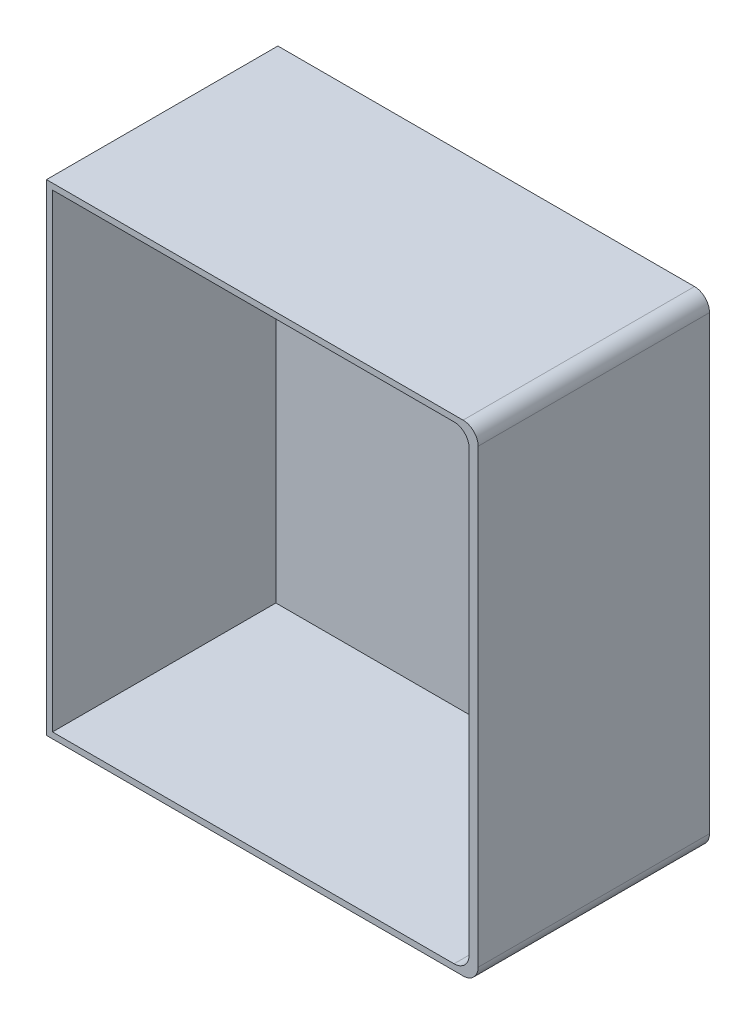
ISO-10303-21;
HEADER;
FILE_DESCRIPTION(('STEP AP214'),'2;1');
FILE_NAME('part.step','',(''),(''),'','','');
FILE_SCHEMA(('AUTOMOTIVE_DESIGN { 1 0 10303 214 1 1 1 1 }'));
ENDSEC;
DATA;
#1=APPLICATION_CONTEXT('core data for automotive mechanical design processes');
#2=APPLICATION_PROTOCOL_DEFINITION('international standard','automotive_design',2000,#1);
#3=PRODUCT_CONTEXT('',#1,'mechanical');
#4=PRODUCT('Part','Part','',(#3));
#5=PRODUCT_RELATED_PRODUCT_CATEGORY('part','',(#4));
#6=PRODUCT_DEFINITION_FORMATION('','',#4);
#7=PRODUCT_DEFINITION_CONTEXT('part definition',#1,'design');
#8=PRODUCT_DEFINITION('design','',#6,#7);
#9=PRODUCT_DEFINITION_SHAPE('','',#8);
#10=(LENGTH_UNIT() NAMED_UNIT(*) SI_UNIT(.MILLI.,.METRE.));
#11=(NAMED_UNIT(*) PLANE_ANGLE_UNIT() SI_UNIT($,.RADIAN.));
#12=(NAMED_UNIT(*) SI_UNIT($,.STERADIAN.) SOLID_ANGLE_UNIT());
#13=UNCERTAINTY_MEASURE_WITH_UNIT(LENGTH_MEASURE(1.E-05),#10,'distance_accuracy_value','');
#14=(GEOMETRIC_REPRESENTATION_CONTEXT(3) GLOBAL_UNCERTAINTY_ASSIGNED_CONTEXT((#13)) GLOBAL_UNIT_ASSIGNED_CONTEXT((#10,
#11,#12)) REPRESENTATION_CONTEXT('',''));
#15=CARTESIAN_POINT('',(0.,0.,0.));
#16=DIRECTION('',(0.,0.,1.));
#17=DIRECTION('',(1.,0.,0.));
#18=AXIS2_PLACEMENT_3D('',#15,#16,#17);
#19=CARTESIAN_POINT('',(-43.,47.95,46.1));
#20=DIRECTION('',(1.,0.,0.));
#21=DIRECTION('',(0.,1.,0.));
#22=AXIS2_PLACEMENT_3D('',#19,#20,#21);
#23=PLANE('',#22);
#24=DIRECTION('',(0.,0.,-1.));
#25=VECTOR('',#24,1.);
#26=CARTESIAN_POINT('',(-43.,-42.95,4.99999999999999));
#27=LINE('',#26,#25);
#28=CARTESIAN_POINT('',(-43.,-42.95,4.99999999999999));
#29=VERTEX_POINT('',#28);
#30=CARTESIAN_POINT('',(-43.,-42.95,0.));
#31=VERTEX_POINT('',#30);
#32=EDGE_CURVE('E218',#29,#31,#27,.T.);
#33=ORIENTED_EDGE('',*,*,#32,.T.);
#34=DIRECTION('',(0.,-1.,0.));
#35=VECTOR('',#34,1.);
#36=CARTESIAN_POINT('',(-43.,47.95,0.));
#37=LINE('',#36,#35);
#38=CARTESIAN_POINT('',(-43.,-47.95,0.));
#39=VERTEX_POINT('',#38);
#40=EDGE_CURVE('E238',#31,#39,#37,.T.);
#41=ORIENTED_EDGE('',*,*,#40,.T.);
#42=DIRECTION('',(0.,0.,-1.));
#43=VECTOR('',#42,1.);
#44=CARTESIAN_POINT('',(-43.,-47.95,46.1));
#45=LINE('',#44,#43);
#46=CARTESIAN_POINT('',(-43.,-47.95,46.1));
#47=VERTEX_POINT('',#46);
#48=EDGE_CURVE('E231',#47,#39,#45,.T.);
#49=ORIENTED_EDGE('',*,*,#48,.F.);
#50=DIRECTION('',(0.,-1.,0.));
#51=VECTOR('',#50,1.);
#52=CARTESIAN_POINT('',(-43.,47.95,46.1));
#53=LINE('',#52,#51);
#54=CARTESIAN_POINT('',(-43.,47.95,46.1));
#55=VERTEX_POINT('',#54);
#56=EDGE_CURVE('E229',#55,#47,#53,.T.);
#57=ORIENTED_EDGE('',*,*,#56,.F.);
#58=DIRECTION('',(0.,0.,-1.));
#59=VECTOR('',#58,1.);
#60=CARTESIAN_POINT('',(-43.,47.95,46.1));
#61=LINE('',#60,#59);
#62=CARTESIAN_POINT('',(-43.,47.95,0.));
#63=VERTEX_POINT('',#62);
#64=EDGE_CURVE('E243',#55,#63,#61,.T.);
#65=ORIENTED_EDGE('',*,*,#64,.T.);
#66=CARTESIAN_POINT('',(-43.,42.95,0.));
#67=VERTEX_POINT('',#66);
#68=EDGE_CURVE('E225',#63,#67,#37,.T.);
#69=ORIENTED_EDGE('',*,*,#68,.T.);
#70=DIRECTION('',(0.,0.,-1.));
#71=VECTOR('',#70,1.);
#72=CARTESIAN_POINT('',(-43.,42.95,4.99999999999999));
#73=LINE('',#72,#71);
#74=CARTESIAN_POINT('',(-43.,42.95,4.99999999999999));
#75=VERTEX_POINT('',#74);
#76=EDGE_CURVE('E205',#75,#67,#73,.T.);
#77=ORIENTED_EDGE('',*,*,#76,.F.);
#78=DIRECTION('',(0.,1.,0.));
#79=VECTOR('',#78,1.);
#80=CARTESIAN_POINT('',(-43.,42.95,4.99999999999999));
#81=LINE('',#80,#79);
#82=CARTESIAN_POINT('',(-43.,35.8706356230274,4.99999999999999));
#83=VERTEX_POINT('',#82);
#84=EDGE_CURVE('E202',#83,#75,#81,.T.);
#85=ORIENTED_EDGE('',*,*,#84,.F.);
#86=DIRECTION('',(0.,0.,-1.));
#87=VECTOR('',#86,1.);
#88=CARTESIAN_POINT('',(-43.,35.8706356230273,4.99999999999999));
#89=LINE('',#88,#87);
#90=CARTESIAN_POINT('',(-43.,35.8706356230273,0.));
#91=VERTEX_POINT('',#90);
#92=EDGE_CURVE('E212',#83,#91,#89,.T.);
#93=ORIENTED_EDGE('',*,*,#92,.T.);
#94=CARTESIAN_POINT('',(-43.,-35.8706356230274,0.));
#95=VERTEX_POINT('',#94);
#96=EDGE_CURVE('E240',#91,#95,#37,.T.);
#97=ORIENTED_EDGE('',*,*,#96,.T.);
#98=DIRECTION('',(0.,0.,-1.));
#99=VECTOR('',#98,1.);
#100=CARTESIAN_POINT('',(-43.,-35.8706356230273,4.99999999999999));
#101=LINE('',#100,#99);
#102=CARTESIAN_POINT('',(-43.,-35.8706356230273,4.99999999999999));
#103=VERTEX_POINT('',#102);
#104=EDGE_CURVE('E215',#103,#95,#101,.T.);
#105=ORIENTED_EDGE('',*,*,#104,.F.);
#106=DIRECTION('',(0.,1.,0.));
#107=VECTOR('',#106,1.);
#108=CARTESIAN_POINT('',(-43.,-42.95,4.99999999999999));
#109=LINE('',#108,#107);
#110=EDGE_CURVE('E195',#29,#103,#109,.T.);
#111=ORIENTED_EDGE('',*,*,#110,.F.);
#112=EDGE_LOOP('',(#33,#41,#49,#57,#65,#69,#77,#85,#93,#97,#105,#111));
#113=FACE_BOUND('',#112,.T.);
#114=ADVANCED_FACE('F41',(#113),#23,.F.);
#115=CARTESIAN_POINT('',(-43.,-47.95,46.1));
#116=DIRECTION('',(0.,1.,0.));
#117=DIRECTION('',(0.,0.,1.));
#118=AXIS2_PLACEMENT_3D('',#115,#116,#117);
#119=PLANE('',#118);
#120=DIRECTION('',(1.,0.,0.));
#121=VECTOR('',#120,1.);
#122=CARTESIAN_POINT('',(-43.,-47.95,0.));
#123=LINE('',#122,#121);
#124=CARTESIAN_POINT('',(40.,-47.95,0.));
#125=VERTEX_POINT('',#124);
#126=EDGE_CURVE('E221',#39,#125,#123,.T.);
#127=ORIENTED_EDGE('',*,*,#126,.T.);
#128=DIRECTION('',(0.,0.,-1.));
#129=VECTOR('',#128,1.);
#130=CARTESIAN_POINT('',(40.,-47.95,46.1));
#131=LINE('',#130,#129);
#132=CARTESIAN_POINT('',(40.,-47.95,46.1));
#133=VERTEX_POINT('',#132);
#134=EDGE_CURVE('E64',#125,#133,#131,.F.);
#135=ORIENTED_EDGE('',*,*,#134,.T.);
#136=DIRECTION('',(1.,0.,0.));
#137=VECTOR('',#136,1.);
#138=CARTESIAN_POINT('',(-43.,-47.95,46.1));
#139=LINE('',#138,#137);
#140=EDGE_CURVE('E222',#47,#133,#139,.T.);
#141=ORIENTED_EDGE('',*,*,#140,.F.);
#142=ORIENTED_EDGE('',*,*,#48,.T.);
#143=EDGE_LOOP('',(#127,#135,#141,#142));
#144=FACE_BOUND('',#143,.T.);
#145=ADVANCED_FACE('F306',(#144),#119,.F.);
#146=CARTESIAN_POINT('',(43.,-47.95,46.1));
#147=DIRECTION('',(-1.,0.,0.));
#148=DIRECTION('',(0.,0.,1.));
#149=AXIS2_PLACEMENT_3D('',#146,#147,#148);
#150=PLANE('',#149);
#151=DIRECTION('',(0.,1.,0.));
#152=VECTOR('',#151,1.);
#153=CARTESIAN_POINT('',(43.,-47.95,46.1));
#154=LINE('',#153,#152);
#155=CARTESIAN_POINT('',(43.,-44.95,46.1));
#156=VERTEX_POINT('',#155);
#157=CARTESIAN_POINT('',(43.,44.95,46.1));
#158=VERTEX_POINT('',#157);
#159=EDGE_CURVE('E224',#156,#158,#154,.T.);
#160=ORIENTED_EDGE('',*,*,#159,.F.);
#161=DIRECTION('',(0.,0.,-1.));
#162=VECTOR('',#161,1.);
#163=CARTESIAN_POINT('',(43.,-44.95,46.1));
#164=LINE('',#163,#162);
#165=CARTESIAN_POINT('',(43.,-44.95,0.));
#166=VERTEX_POINT('',#165);
#167=EDGE_CURVE('E260',#156,#166,#164,.T.);
#168=ORIENTED_EDGE('',*,*,#167,.T.);
#169=DIRECTION('',(0.,1.,0.));
#170=VECTOR('',#169,1.);
#171=CARTESIAN_POINT('',(43.,-47.95,0.));
#172=LINE('',#171,#170);
#173=CARTESIAN_POINT('',(43.,44.95,0.));
#174=VERTEX_POINT('',#173);
#175=EDGE_CURVE('E233',#166,#174,#172,.T.);
#176=ORIENTED_EDGE('',*,*,#175,.T.);
#177=DIRECTION('',(0.,0.,-1.));
#178=VECTOR('',#177,1.);
#179=CARTESIAN_POINT('',(43.,44.95,46.1));
#180=LINE('',#179,#178);
#181=EDGE_CURVE('E258',#174,#158,#180,.F.);
#182=ORIENTED_EDGE('',*,*,#181,.T.);
#183=EDGE_LOOP('',(#160,#168,#176,#182));
#184=FACE_BOUND('',#183,.T.);
#185=ADVANCED_FACE('F312',(#184),#150,.F.);
#186=CARTESIAN_POINT('',(43.,47.95,46.1));
#187=DIRECTION('',(0.,-1.,0.));
#188=DIRECTION('',(1.,0.,0.));
#189=AXIS2_PLACEMENT_3D('',#186,#187,#188);
#190=PLANE('',#189);
#191=DIRECTION('',(-1.,0.,0.));
#192=VECTOR('',#191,1.);
#193=CARTESIAN_POINT('',(43.,47.95,46.1));
#194=LINE('',#193,#192);
#195=CARTESIAN_POINT('',(40.,47.95,46.1));
#196=VERTEX_POINT('',#195);
#197=EDGE_CURVE('E227',#196,#55,#194,.T.);
#198=ORIENTED_EDGE('',*,*,#197,.F.);
#199=DIRECTION('',(0.,0.,-1.));
#200=VECTOR('',#199,1.);
#201=CARTESIAN_POINT('',(40.,47.95,46.1));
#202=LINE('',#201,#200);
#203=CARTESIAN_POINT('',(40.,47.95,0.));
#204=VERTEX_POINT('',#203);
#205=EDGE_CURVE('E271',#196,#204,#202,.T.);
#206=ORIENTED_EDGE('',*,*,#205,.T.);
#207=DIRECTION('',(-1.,0.,0.));
#208=VECTOR('',#207,1.);
#209=CARTESIAN_POINT('',(43.,47.95,0.));
#210=LINE('',#209,#208);
#211=EDGE_CURVE('E236',#204,#63,#210,.T.);
#212=ORIENTED_EDGE('',*,*,#211,.T.);
#213=ORIENTED_EDGE('',*,*,#64,.F.);
#214=EDGE_LOOP('',(#198,#206,#212,#213));
#215=FACE_BOUND('',#214,.T.);
#216=ADVANCED_FACE('F318',(#215),#190,.F.);
#217=CARTESIAN_POINT('',(0.,0.,46.1));
#218=DIRECTION('',(0.,0.,1.));
#219=DIRECTION('',(1.,0.,0.));
#220=AXIS2_PLACEMENT_3D('',#217,#218,#219);
#221=PLANE('',#220);
#222=DIRECTION('',(0.,1.,0.));
#223=VECTOR('',#222,1.);
#224=CARTESIAN_POINT('',(41.2,-46.75,46.1));
#225=LINE('',#224,#223);
#226=CARTESIAN_POINT('',(41.2,-43.75,46.1));
#227=VERTEX_POINT('',#226);
#228=CARTESIAN_POINT('',(41.2,43.75,46.1));
#229=VERTEX_POINT('',#228);
#230=EDGE_CURVE('E168',#227,#229,#225,.T.);
#231=ORIENTED_EDGE('',*,*,#230,.F.);
#232=CARTESIAN_POINT('',(38.2,-43.75,46.1));
#233=DIRECTION('',(0.,0.,1.));
#234=DIRECTION('',(1.,0.,0.));
#235=AXIS2_PLACEMENT_3D('',#232,#233,#234);
#236=CIRCLE('',#235,3.);
#237=CARTESIAN_POINT('',(38.2,-46.75,46.1));
#238=VERTEX_POINT('',#237);
#239=EDGE_CURVE('E49',#227,#238,#236,.F.);
#240=ORIENTED_EDGE('',*,*,#239,.T.);
#241=DIRECTION('',(1.,0.,0.));
#242=VECTOR('',#241,1.);
#243=CARTESIAN_POINT('',(-41.8,-46.75,46.1));
#244=LINE('',#243,#242);
#245=CARTESIAN_POINT('',(-41.8,-46.75,46.1));
#246=VERTEX_POINT('',#245);
#247=EDGE_CURVE('E178',#246,#238,#244,.T.);
#248=ORIENTED_EDGE('',*,*,#247,.F.);
#249=DIRECTION('',(0.,-1.,0.));
#250=VECTOR('',#249,1.);
#251=CARTESIAN_POINT('',(-41.8,46.75,46.1));
#252=LINE('',#251,#250);
#253=CARTESIAN_POINT('',(-41.8,46.75,46.1));
#254=VERTEX_POINT('',#253);
#255=EDGE_CURVE('E167',#254,#246,#252,.T.);
#256=ORIENTED_EDGE('',*,*,#255,.F.);
#257=DIRECTION('',(-1.,0.,0.));
#258=VECTOR('',#257,1.);
#259=CARTESIAN_POINT('',(41.2,46.75,46.1));
#260=LINE('',#259,#258);
#261=CARTESIAN_POINT('',(38.2,46.75,46.1));
#262=VERTEX_POINT('',#261);
#263=EDGE_CURVE('E157',#262,#254,#260,.T.);
#264=ORIENTED_EDGE('',*,*,#263,.F.);
#265=CARTESIAN_POINT('',(38.2,43.75,46.1));
#266=DIRECTION('',(0.,0.,1.));
#267=DIRECTION('',(1.,0.,0.));
#268=AXIS2_PLACEMENT_3D('',#265,#266,#267);
#269=CIRCLE('',#268,3.);
#270=EDGE_CURVE('E12',#262,#229,#269,.F.);
#271=ORIENTED_EDGE('',*,*,#270,.T.);
#272=EDGE_LOOP('',(#231,#240,#248,#256,#264,#271));
#273=FACE_BOUND('',#272,.T.);
#274=ORIENTED_EDGE('',*,*,#140,.T.);
#275=CARTESIAN_POINT('',(40.,-44.95,46.1));
#276=DIRECTION('',(0.,0.,1.));
#277=DIRECTION('',(1.,0.,0.));
#278=AXIS2_PLACEMENT_3D('',#275,#276,#277);
#279=CIRCLE('',#278,3.);
#280=EDGE_CURVE('E269',#133,#156,#279,.T.);
#281=ORIENTED_EDGE('',*,*,#280,.T.);
#282=ORIENTED_EDGE('',*,*,#159,.T.);
#283=CARTESIAN_POINT('',(40.,44.95,46.1));
#284=DIRECTION('',(0.,0.,1.));
#285=DIRECTION('',(1.,0.,0.));
#286=AXIS2_PLACEMENT_3D('',#283,#284,#285);
#287=CIRCLE('',#286,3.);
#288=EDGE_CURVE('E56',#158,#196,#287,.T.);
#289=ORIENTED_EDGE('',*,*,#288,.T.);
#290=ORIENTED_EDGE('',*,*,#197,.T.);
#291=ORIENTED_EDGE('',*,*,#56,.T.);
#292=EDGE_LOOP('',(#274,#281,#282,#289,#290,#291));
#293=FACE_BOUND('',#292,.T.);
#294=ADVANCED_FACE('F181',(#273,#293),#221,.T.);
#295=CARTESIAN_POINT('',(0.,0.,0.));
#296=DIRECTION('',(0.,0.,1.));
#297=DIRECTION('',(1.,0.,0.));
#298=AXIS2_PLACEMENT_3D('',#295,#296,#297);
#299=PLANE('',#298);
#300=CARTESIAN_POINT('',(14.4748640711746,0.,0.));
#301=DIRECTION('',(0.,0.,-1.));
#302=DIRECTION('',(1.,0.,0.));
#303=AXIS2_PLACEMENT_3D('',#300,#301,#302);
#304=CIRCLE('',#303,67.75);
#305=EDGE_CURVE('E196',#95,#91,#304,.T.);
#306=ORIENTED_EDGE('',*,*,#305,.F.);
#307=ORIENTED_EDGE('',*,*,#96,.F.);
#308=EDGE_LOOP('',(#306,#307));
#309=FACE_BOUND('',#308,.T.);
#310=ORIENTED_EDGE('',*,*,#175,.F.);
#311=CARTESIAN_POINT('',(40.,-44.95,0.));
#312=DIRECTION('',(0.,0.,1.));
#313=DIRECTION('',(1.,0.,0.));
#314=AXIS2_PLACEMENT_3D('',#311,#312,#313);
#315=CIRCLE('',#314,3.);
#316=EDGE_CURVE('E265',#166,#125,#315,.F.);
#317=ORIENTED_EDGE('',*,*,#316,.T.);
#318=ORIENTED_EDGE('',*,*,#126,.F.);
#319=ORIENTED_EDGE('',*,*,#40,.F.);
#320=CARTESIAN_POINT('',(14.4748640711746,0.,0.));
#321=DIRECTION('',(0.,0.,1.));
#322=DIRECTION('',(-1.,0.,0.));
#323=AXIS2_PLACEMENT_3D('',#320,#321,#322);
#324=CIRCLE('',#323,71.75);
#325=EDGE_CURVE('E190',#67,#31,#324,.T.);
#326=ORIENTED_EDGE('',*,*,#325,.F.);
#327=ORIENTED_EDGE('',*,*,#68,.F.);
#328=ORIENTED_EDGE('',*,*,#211,.F.);
#329=CARTESIAN_POINT('',(40.,44.95,0.));
#330=DIRECTION('',(0.,0.,1.));
#331=DIRECTION('',(1.,0.,0.));
#332=AXIS2_PLACEMENT_3D('',#329,#330,#331);
#333=CIRCLE('',#332,3.);
#334=EDGE_CURVE('E263',#204,#174,#333,.F.);
#335=ORIENTED_EDGE('',*,*,#334,.T.);
#336=EDGE_LOOP('',(#310,#317,#318,#319,#326,#327,#328,#335));
#337=FACE_BOUND('',#336,.T.);
#338=ADVANCED_FACE('F316',(#309,#337),#299,.F.);
#339=CARTESIAN_POINT('',(14.4748640711746,0.,4.99999999999999));
#340=DIRECTION('',(0.,0.,-1.));
#341=DIRECTION('',(-1.,0.,0.));
#342=AXIS2_PLACEMENT_3D('',#339,#340,#341);
#343=CYLINDRICAL_SURFACE('',#342,71.75);
#344=ORIENTED_EDGE('',*,*,#325,.T.);
#345=ORIENTED_EDGE('',*,*,#32,.F.);
#346=CARTESIAN_POINT('',(14.4748640711746,0.,4.99999999999999));
#347=DIRECTION('',(0.,0.,1.));
#348=DIRECTION('',(-1.,0.,0.));
#349=AXIS2_PLACEMENT_3D('',#346,#347,#348);
#350=CIRCLE('',#349,71.75);
#351=EDGE_CURVE('E192',#75,#29,#350,.T.);
#352=ORIENTED_EDGE('',*,*,#351,.F.);
#353=ORIENTED_EDGE('',*,*,#76,.T.);
#354=EDGE_LOOP('',(#344,#345,#352,#353));
#355=FACE_BOUND('',#354,.T.);
#356=ADVANCED_FACE('F344',(#355),#343,.T.);
#357=CARTESIAN_POINT('',(14.4748640711746,0.,4.99999999999999));
#358=DIRECTION('',(0.,0.,-1.));
#359=DIRECTION('',(-1.,0.,0.));
#360=AXIS2_PLACEMENT_3D('',#357,#358,#359);
#361=CYLINDRICAL_SURFACE('',#360,67.75);
#362=ORIENTED_EDGE('',*,*,#305,.T.);
#363=ORIENTED_EDGE('',*,*,#92,.F.);
#364=CARTESIAN_POINT('',(14.4748640711746,0.,4.99999999999999));
#365=DIRECTION('',(0.,0.,-1.));
#366=DIRECTION('',(1.,0.,0.));
#367=AXIS2_PLACEMENT_3D('',#364,#365,#366);
#368=CIRCLE('',#367,67.75);
#369=EDGE_CURVE('E199',#103,#83,#368,.T.);
#370=ORIENTED_EDGE('',*,*,#369,.F.);
#371=ORIENTED_EDGE('',*,*,#104,.T.);
#372=EDGE_LOOP('',(#362,#363,#370,#371));
#373=FACE_BOUND('',#372,.T.);
#374=ADVANCED_FACE('F342',(#373),#361,.F.);
#375=CARTESIAN_POINT('',(14.4748640711746,0.,4.99999999999999));
#376=DIRECTION('',(0.,0.,-1.));
#377=DIRECTION('',(-1.,0.,0.));
#378=AXIS2_PLACEMENT_3D('',#375,#376,#377);
#379=PLANE('',#378);
#380=ORIENTED_EDGE('',*,*,#351,.T.);
#381=ORIENTED_EDGE('',*,*,#110,.T.);
#382=ORIENTED_EDGE('',*,*,#369,.T.);
#383=ORIENTED_EDGE('',*,*,#84,.T.);
#384=EDGE_LOOP('',(#380,#381,#382,#383));
#385=FACE_BOUND('',#384,.T.);
#386=ADVANCED_FACE('F356',(#385),#379,.F.);
#387=CARTESIAN_POINT('',(41.2,-46.75,-125.0249975005));
#388=DIRECTION('',(1.,0.,0.));
#389=DIRECTION('',(0.,0.,-1.));
#390=AXIS2_PLACEMENT_3D('',#387,#388,#389);
#391=PLANE('',#390);
#392=DIRECTION('',(0.,-1.,0.));
#393=VECTOR('',#392,1.);
#394=CARTESIAN_POINT('',(41.2,-46.75,1.59999999999999));
#395=LINE('',#394,#393);
#396=CARTESIAN_POINT('',(41.2,43.75,1.59999999999999));
#397=VERTEX_POINT('',#396);
#398=CARTESIAN_POINT('',(41.2,-43.75,1.59999999999999));
#399=VERTEX_POINT('',#398);
#400=EDGE_CURVE('E191',#397,#399,#395,.T.);
#401=ORIENTED_EDGE('',*,*,#400,.T.);
#402=DIRECTION('',(0.,0.,1.));
#403=VECTOR('',#402,1.);
#404=CARTESIAN_POINT('',(41.2,-43.75,46.1));
#405=LINE('',#404,#403);
#406=EDGE_CURVE('E248',#399,#227,#405,.T.);
#407=ORIENTED_EDGE('',*,*,#406,.T.);
#408=ORIENTED_EDGE('',*,*,#230,.T.);
#409=DIRECTION('',(0.,0.,1.));
#410=VECTOR('',#409,1.);
#411=CARTESIAN_POINT('',(41.2,43.75,1.59999999999999));
#412=LINE('',#411,#410);
#413=EDGE_CURVE('E246',#229,#397,#412,.F.);
#414=ORIENTED_EDGE('',*,*,#413,.T.);
#415=EDGE_LOOP('',(#401,#407,#408,#414));
#416=FACE_BOUND('',#415,.T.);
#417=ADVANCED_FACE('F289',(#416),#391,.F.);
#418=CARTESIAN_POINT('',(-41.8,-46.75,-125.0249975005));
#419=DIRECTION('',(0.,-1.,0.));
#420=DIRECTION('',(1.,0.,0.));
#421=AXIS2_PLACEMENT_3D('',#418,#419,#420);
#422=PLANE('',#421);
#423=ORIENTED_EDGE('',*,*,#247,.T.);
#424=DIRECTION('',(0.,0.,1.));
#425=VECTOR('',#424,1.);
#426=CARTESIAN_POINT('',(38.2,-46.75,1.59999999999999));
#427=LINE('',#426,#425);
#428=CARTESIAN_POINT('',(38.2,-46.75,1.59999999999999));
#429=VERTEX_POINT('',#428);
#430=EDGE_CURVE('E251',#238,#429,#427,.F.);
#431=ORIENTED_EDGE('',*,*,#430,.T.);
#432=DIRECTION('',(-1.,0.,0.));
#433=VECTOR('',#432,1.);
#434=CARTESIAN_POINT('',(-41.8,-46.75,1.59999999999999));
#435=LINE('',#434,#433);
#436=CARTESIAN_POINT('',(-41.8,-46.75,1.59999999999999));
#437=VERTEX_POINT('',#436);
#438=EDGE_CURVE('E287',#429,#437,#435,.T.);
#439=ORIENTED_EDGE('',*,*,#438,.T.);
#440=DIRECTION('',(0.,0.,1.));
#441=VECTOR('',#440,1.);
#442=CARTESIAN_POINT('',(-41.8,-46.75,-125.0249975005));
#443=LINE('',#442,#441);
#444=EDGE_CURVE('E177',#437,#246,#443,.T.);
#445=ORIENTED_EDGE('',*,*,#444,.T.);
#446=EDGE_LOOP('',(#423,#431,#439,#445));
#447=FACE_BOUND('',#446,.T.);
#448=ADVANCED_FACE('F278',(#447),#422,.F.);
#449=CARTESIAN_POINT('',(-41.8,46.75,-125.0249975005));
#450=DIRECTION('',(-1.,0.,0.));
#451=DIRECTION('',(0.,-1.,0.));
#452=AXIS2_PLACEMENT_3D('',#449,#450,#451);
#453=PLANE('',#452);
#454=DIRECTION('',(0.,1.,0.));
#455=VECTOR('',#454,1.);
#456=CARTESIAN_POINT('',(-41.8,46.75,1.59999999999999));
#457=LINE('',#456,#455);
#458=CARTESIAN_POINT('',(-41.8,46.75,1.59999999999993));
#459=VERTEX_POINT('',#458);
#460=EDGE_CURVE('E176',#437,#459,#457,.T.);
#461=ORIENTED_EDGE('',*,*,#460,.T.);
#462=DIRECTION('',(0.,0.,1.));
#463=VECTOR('',#462,1.);
#464=CARTESIAN_POINT('',(-41.8,46.75,-125.0249975005));
#465=LINE('',#464,#463);
#466=EDGE_CURVE('E161',#459,#254,#465,.T.);
#467=ORIENTED_EDGE('',*,*,#466,.T.);
#468=ORIENTED_EDGE('',*,*,#255,.T.);
#469=ORIENTED_EDGE('',*,*,#444,.F.);
#470=EDGE_LOOP('',(#461,#467,#468,#469));
#471=FACE_BOUND('',#470,.T.);
#472=ADVANCED_FACE('F172',(#471),#453,.F.);
#473=CARTESIAN_POINT('',(41.2,46.75,-125.0249975005));
#474=DIRECTION('',(0.,1.,0.));
#475=DIRECTION('',(-1.,0.,0.));
#476=AXIS2_PLACEMENT_3D('',#473,#474,#475);
#477=PLANE('',#476);
#478=DIRECTION('',(1.,0.,0.));
#479=VECTOR('',#478,1.);
#480=CARTESIAN_POINT('',(41.2,46.75,1.59999999999999));
#481=LINE('',#480,#479);
#482=CARTESIAN_POINT('',(38.2,46.75,1.59999999999999));
#483=VERTEX_POINT('',#482);
#484=EDGE_CURVE('E188',#459,#483,#481,.T.);
#485=ORIENTED_EDGE('',*,*,#484,.T.);
#486=DIRECTION('',(0.,0.,1.));
#487=VECTOR('',#486,1.);
#488=CARTESIAN_POINT('',(38.2,46.75,46.1));
#489=LINE('',#488,#487);
#490=EDGE_CURVE('E164',#483,#262,#489,.T.);
#491=ORIENTED_EDGE('',*,*,#490,.T.);
#492=ORIENTED_EDGE('',*,*,#263,.T.);
#493=ORIENTED_EDGE('',*,*,#466,.F.);
#494=EDGE_LOOP('',(#485,#491,#492,#493));
#495=FACE_BOUND('',#494,.T.);
#496=ADVANCED_FACE('F160',(#495),#477,.F.);
#497=CARTESIAN_POINT('',(0.,0.,1.6));
#498=DIRECTION('',(0.,0.,1.));
#499=DIRECTION('',(1.,0.,0.));
#500=AXIS2_PLACEMENT_3D('',#497,#498,#499);
#501=PLANE('',#500);
#502=ORIENTED_EDGE('',*,*,#438,.F.);
#503=CARTESIAN_POINT('',(38.2,-43.75,1.59999999999999));
#504=DIRECTION('',(0.,0.,1.));
#505=DIRECTION('',(1.,0.,0.));
#506=AXIS2_PLACEMENT_3D('',#503,#504,#505);
#507=CIRCLE('',#506,3.);
#508=EDGE_CURVE('E255',#429,#399,#507,.T.);
#509=ORIENTED_EDGE('',*,*,#508,.T.);
#510=ORIENTED_EDGE('',*,*,#400,.F.);
#511=CARTESIAN_POINT('',(38.2,43.75,1.59999999999999));
#512=DIRECTION('',(0.,0.,1.));
#513=DIRECTION('',(1.,0.,0.));
#514=AXIS2_PLACEMENT_3D('',#511,#512,#513);
#515=CIRCLE('',#514,3.);
#516=EDGE_CURVE('E253',#397,#483,#515,.T.);
#517=ORIENTED_EDGE('',*,*,#516,.T.);
#518=ORIENTED_EDGE('',*,*,#484,.F.);
#519=ORIENTED_EDGE('',*,*,#460,.F.);
#520=EDGE_LOOP('',(#502,#509,#510,#517,#518,#519));
#521=FACE_BOUND('',#520,.T.);
#522=ADVANCED_FACE('F285',(#521),#501,.T.);
#523=CARTESIAN_POINT('',(38.2,-43.75,-125.0249975005));
#524=DIRECTION('',(0.,0.,-1.));
#525=DIRECTION('',(-1.,0.,0.));
#526=AXIS2_PLACEMENT_3D('',#523,#524,#525);
#527=CYLINDRICAL_SURFACE('',#526,3.);
#528=ORIENTED_EDGE('',*,*,#508,.F.);
#529=ORIENTED_EDGE('',*,*,#430,.F.);
#530=ORIENTED_EDGE('',*,*,#239,.F.);
#531=ORIENTED_EDGE('',*,*,#406,.F.);
#532=EDGE_LOOP('',(#528,#529,#530,#531));
#533=FACE_BOUND('',#532,.T.);
#534=ADVANCED_FACE('F281',(#533),#527,.F.);
#535=CARTESIAN_POINT('',(38.2,43.75,-125.0249975005));
#536=DIRECTION('',(0.,0.,-1.));
#537=DIRECTION('',(-1.,0.,0.));
#538=AXIS2_PLACEMENT_3D('',#535,#536,#537);
#539=CYLINDRICAL_SURFACE('',#538,3.);
#540=ORIENTED_EDGE('',*,*,#516,.F.);
#541=ORIENTED_EDGE('',*,*,#413,.F.);
#542=ORIENTED_EDGE('',*,*,#270,.F.);
#543=ORIENTED_EDGE('',*,*,#490,.F.);
#544=EDGE_LOOP('',(#540,#541,#542,#543));
#545=FACE_BOUND('',#544,.T.);
#546=ADVANCED_FACE('F295',(#545),#539,.F.);
#547=CARTESIAN_POINT('',(40.,-44.95,46.1));
#548=DIRECTION('',(0.,0.,-1.));
#549=DIRECTION('',(-1.,0.,0.));
#550=AXIS2_PLACEMENT_3D('',#547,#548,#549);
#551=CYLINDRICAL_SURFACE('',#550,3.);
#552=ORIENTED_EDGE('',*,*,#280,.F.);
#553=ORIENTED_EDGE('',*,*,#134,.F.);
#554=ORIENTED_EDGE('',*,*,#316,.F.);
#555=ORIENTED_EDGE('',*,*,#167,.F.);
#556=EDGE_LOOP('',(#552,#553,#554,#555));
#557=FACE_BOUND('',#556,.T.);
#558=ADVANCED_FACE('F297',(#557),#551,.T.);
#559=CARTESIAN_POINT('',(40.,44.95,46.1));
#560=DIRECTION('',(0.,0.,-1.));
#561=DIRECTION('',(-1.,0.,0.));
#562=AXIS2_PLACEMENT_3D('',#559,#560,#561);
#563=CYLINDRICAL_SURFACE('',#562,3.);
#564=ORIENTED_EDGE('',*,*,#288,.F.);
#565=ORIENTED_EDGE('',*,*,#181,.F.);
#566=ORIENTED_EDGE('',*,*,#334,.F.);
#567=ORIENTED_EDGE('',*,*,#205,.F.);
#568=EDGE_LOOP('',(#564,#565,#566,#567));
#569=FACE_BOUND('',#568,.T.);
#570=ADVANCED_FACE('F43',(#569),#563,.T.);
#571=CLOSED_SHELL('',(#114,#145,#185,#216,#294,#338,#356,#374,#386,#417,#448,#472,#496,#522,
#534,#546,#558,#570));
#572=MANIFOLD_SOLID_BREP('B2',#571);
#573=ADVANCED_BREP_SHAPE_REPRESENTATION('',(#18,#572),#14);
#574=SHAPE_DEFINITION_REPRESENTATION(#9,#573);
ENDSEC;
END-ISO-10303-21;
